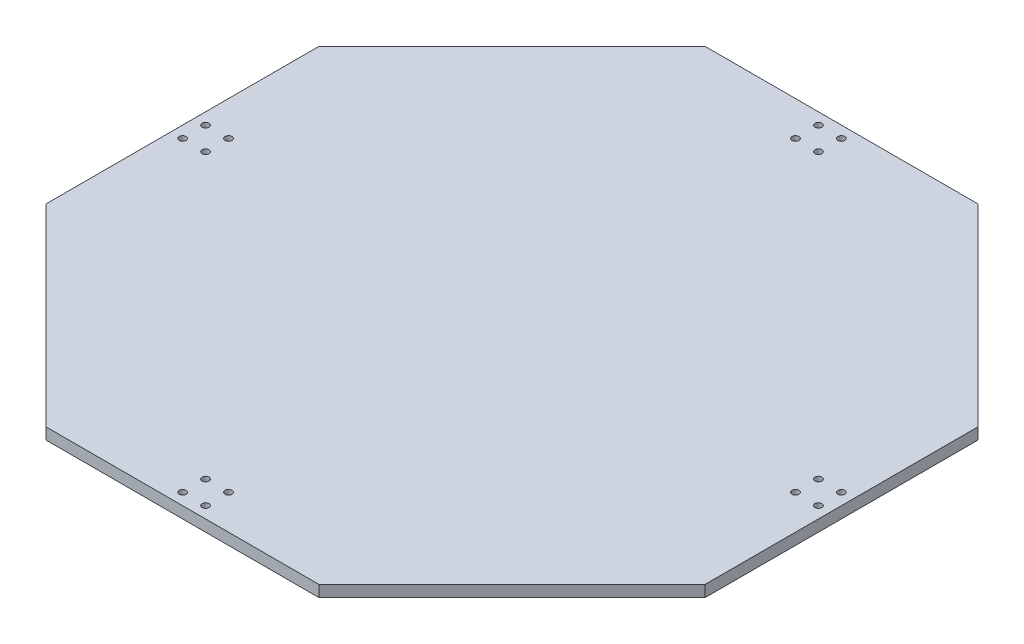
ISO-10303-21;
HEADER;
FILE_DESCRIPTION(('STEP AP214'),'2;1');
FILE_NAME('part.step','',(''),(''),'','','');
FILE_SCHEMA(('AUTOMOTIVE_DESIGN { 1 0 10303 214 1 1 1 1 }'));
ENDSEC;
DATA;
#1=APPLICATION_CONTEXT('core data for automotive mechanical design processes');
#2=APPLICATION_PROTOCOL_DEFINITION('international standard','automotive_design',2000,#1);
#3=PRODUCT_CONTEXT('',#1,'mechanical');
#4=PRODUCT('Part','Part','',(#3));
#5=PRODUCT_RELATED_PRODUCT_CATEGORY('part','',(#4));
#6=PRODUCT_DEFINITION_FORMATION('','',#4);
#7=PRODUCT_DEFINITION_CONTEXT('part definition',#1,'design');
#8=PRODUCT_DEFINITION('design','',#6,#7);
#9=PRODUCT_DEFINITION_SHAPE('','',#8);
#10=(LENGTH_UNIT() NAMED_UNIT(*) SI_UNIT(.MILLI.,.METRE.));
#11=(NAMED_UNIT(*) PLANE_ANGLE_UNIT() SI_UNIT($,.RADIAN.));
#12=(NAMED_UNIT(*) SI_UNIT($,.STERADIAN.) SOLID_ANGLE_UNIT());
#13=UNCERTAINTY_MEASURE_WITH_UNIT(LENGTH_MEASURE(1.E-05),#10,'distance_accuracy_value','');
#14=(GEOMETRIC_REPRESENTATION_CONTEXT(3) GLOBAL_UNCERTAINTY_ASSIGNED_CONTEXT((#13)) GLOBAL_UNIT_ASSIGNED_CONTEXT((#10,
#11,#12)) REPRESENTATION_CONTEXT('',''));
#15=CARTESIAN_POINT('',(0.,0.,0.));
#16=DIRECTION('',(0.,0.,1.));
#17=DIRECTION('',(1.,0.,0.));
#18=AXIS2_PLACEMENT_3D('',#15,#16,#17);
#19=CARTESIAN_POINT('',(0.,5.,0.));
#20=DIRECTION('',(0.,1.,0.));
#21=DIRECTION('',(0.,0.,1.));
#22=AXIS2_PLACEMENT_3D('',#19,#20,#21);
#23=PLANE('',#22);
#24=CARTESIAN_POINT('',(-128.539999999997,5.,-4.99999999999743));
#25=DIRECTION('',(0.,1.,0.));
#26=DIRECTION('',(0.,0.,-1.));
#27=AXIS2_PLACEMENT_3D('',#24,#25,#26);
#28=CIRCLE('',#27,1.5);
#29=CARTESIAN_POINT('',(-128.539999999997,5.,-6.49999999999743));
#30=VERTEX_POINT('',#29);
#31=EDGE_CURVE('E259',#30,#30,#28,.T.);
#32=ORIENTED_EDGE('',*,*,#31,.F.);
#33=EDGE_LOOP('',(#32));
#34=FACE_BOUND('',#33,.T.);
#35=CARTESIAN_POINT('',(-138.539999999997,5.,5.00000000000255));
#36=DIRECTION('',(0.,1.,0.));
#37=DIRECTION('',(0.,0.,1.));
#38=AXIS2_PLACEMENT_3D('',#35,#36,#37);
#39=CIRCLE('',#38,1.5);
#40=CARTESIAN_POINT('',(-138.539999999997,5.,6.50000000000255));
#41=VERTEX_POINT('',#40);
#42=EDGE_CURVE('E247',#41,#41,#39,.T.);
#43=ORIENTED_EDGE('',*,*,#42,.F.);
#44=EDGE_LOOP('',(#43));
#45=FACE_BOUND('',#44,.T.);
#46=CARTESIAN_POINT('',(-4.99999999999468,5.,128.54));
#47=DIRECTION('',(0.,1.,0.));
#48=DIRECTION('',(0.,0.,-1.));
#49=AXIS2_PLACEMENT_3D('',#46,#47,#48);
#50=CIRCLE('',#49,1.5);
#51=CARTESIAN_POINT('',(-4.99999999999468,5.,127.04));
#52=VERTEX_POINT('',#51);
#53=EDGE_CURVE('E235',#52,#52,#50,.T.);
#54=ORIENTED_EDGE('',*,*,#53,.F.);
#55=EDGE_LOOP('',(#54));
#56=FACE_BOUND('',#55,.T.);
#57=CARTESIAN_POINT('',(5.00000000000531,5.,138.54));
#58=DIRECTION('',(0.,1.,0.));
#59=DIRECTION('',(0.,0.,1.));
#60=AXIS2_PLACEMENT_3D('',#57,#58,#59);
#61=CIRCLE('',#60,1.50000000000001);
#62=CARTESIAN_POINT('',(5.00000000000531,5.,140.04));
#63=VERTEX_POINT('',#62);
#64=EDGE_CURVE('E223',#63,#63,#61,.T.);
#65=ORIENTED_EDGE('',*,*,#64,.F.);
#66=EDGE_LOOP('',(#65));
#67=FACE_BOUND('',#66,.T.);
#68=CARTESIAN_POINT('',(128.540000000003,5.,4.99999999999723));
#69=DIRECTION('',(0.,1.,0.));
#70=DIRECTION('',(0.,0.,-1.));
#71=AXIS2_PLACEMENT_3D('',#68,#69,#70);
#72=CIRCLE('',#71,1.5);
#73=CARTESIAN_POINT('',(128.540000000003,5.,3.49999999999723));
#74=VERTEX_POINT('',#73);
#75=EDGE_CURVE('E211',#74,#74,#72,.T.);
#76=ORIENTED_EDGE('',*,*,#75,.F.);
#77=EDGE_LOOP('',(#76));
#78=FACE_BOUND('',#77,.T.);
#79=CARTESIAN_POINT('',(138.540000000003,5.,-5.00000000000276));
#80=DIRECTION('',(0.,1.,0.));
#81=DIRECTION('',(0.,0.,1.));
#82=AXIS2_PLACEMENT_3D('',#79,#80,#81);
#83=CIRCLE('',#82,1.5);
#84=CARTESIAN_POINT('',(138.540000000003,5.,-3.50000000000276));
#85=VERTEX_POINT('',#84);
#86=EDGE_CURVE('E199',#85,#85,#83,.T.);
#87=ORIENTED_EDGE('',*,*,#86,.F.);
#88=EDGE_LOOP('',(#87));
#89=FACE_BOUND('',#88,.T.);
#90=CARTESIAN_POINT('',(5.,5.,-128.54));
#91=DIRECTION('',(0.,1.,0.));
#92=DIRECTION('',(0.,0.,-1.));
#93=AXIS2_PLACEMENT_3D('',#90,#91,#92);
#94=CIRCLE('',#93,1.5);
#95=CARTESIAN_POINT('',(5.,5.,-130.04));
#96=VERTEX_POINT('',#95);
#97=EDGE_CURVE('E187',#96,#96,#94,.T.);
#98=ORIENTED_EDGE('',*,*,#97,.F.);
#99=EDGE_LOOP('',(#98));
#100=FACE_BOUND('',#99,.T.);
#101=CARTESIAN_POINT('',(-4.99999999999998,5.,-138.54));
#102=DIRECTION('',(0.,1.,0.));
#103=DIRECTION('',(0.,0.,1.));
#104=AXIS2_PLACEMENT_3D('',#101,#102,#103);
#105=CIRCLE('',#104,1.5);
#106=CARTESIAN_POINT('',(-4.99999999999998,5.,-137.04));
#107=VERTEX_POINT('',#106);
#108=EDGE_CURVE('E133',#107,#107,#105,.T.);
#109=ORIENTED_EDGE('',*,*,#108,.F.);
#110=EDGE_LOOP('',(#109));
#111=FACE_BOUND('',#110,.T.);
#112=DIRECTION('',(1.,0.,0.));
#113=VECTOR('',#112,1.);
#114=CARTESIAN_POINT('',(-59.4810675567764,5.,143.6));
#115=LINE('',#114,#113);
#116=CARTESIAN_POINT('',(-59.4810675567764,5.,143.6));
#117=VERTEX_POINT('',#116);
#118=CARTESIAN_POINT('',(59.4810675567765,5.,143.6));
#119=VERTEX_POINT('',#118);
#120=EDGE_CURVE('E144',#117,#119,#115,.T.);
#121=ORIENTED_EDGE('',*,*,#120,.T.);
#122=DIRECTION('',(0.707106781186547,0.,-0.707106781186548));
#123=VECTOR('',#122,1.);
#124=CARTESIAN_POINT('',(59.4810675567765,5.,143.6));
#125=LINE('',#124,#123);
#126=CARTESIAN_POINT('',(143.6,5.,59.4810675567764));
#127=VERTEX_POINT('',#126);
#128=EDGE_CURVE('E92',#119,#127,#125,.T.);
#129=ORIENTED_EDGE('',*,*,#128,.T.);
#130=DIRECTION('',(0.,0.,-1.));
#131=VECTOR('',#130,1.);
#132=CARTESIAN_POINT('',(143.6,5.,59.4810675567764));
#133=LINE('',#132,#131);
#134=CARTESIAN_POINT('',(143.6,5.,-59.4810675567765));
#135=VERTEX_POINT('',#134);
#136=EDGE_CURVE('E159',#127,#135,#133,.T.);
#137=ORIENTED_EDGE('',*,*,#136,.T.);
#138=DIRECTION('',(-0.707106781186548,0.,-0.707106781186547));
#139=VECTOR('',#138,1.);
#140=CARTESIAN_POINT('',(143.6,5.,-59.4810675567765));
#141=LINE('',#140,#139);
#142=CARTESIAN_POINT('',(59.4810675567764,5.,-143.6));
#143=VERTEX_POINT('',#142);
#144=EDGE_CURVE('E172',#135,#143,#141,.T.);
#145=ORIENTED_EDGE('',*,*,#144,.T.);
#146=DIRECTION('',(-1.,0.,0.));
#147=VECTOR('',#146,1.);
#148=CARTESIAN_POINT('',(59.4810675567764,5.,-143.6));
#149=LINE('',#148,#147);
#150=CARTESIAN_POINT('',(-59.4810675567765,5.,-143.6));
#151=VERTEX_POINT('',#150);
#152=EDGE_CURVE('E111',#143,#151,#149,.T.);
#153=ORIENTED_EDGE('',*,*,#152,.T.);
#154=DIRECTION('',(-0.707106781186547,0.,0.707106781186548));
#155=VECTOR('',#154,1.);
#156=CARTESIAN_POINT('',(-59.4810675567765,5.,-143.6));
#157=LINE('',#156,#155);
#158=CARTESIAN_POINT('',(-143.6,5.,-59.4810675567764));
#159=VERTEX_POINT('',#158);
#160=EDGE_CURVE('E105',#151,#159,#157,.T.);
#161=ORIENTED_EDGE('',*,*,#160,.T.);
#162=DIRECTION('',(0.,0.,1.));
#163=VECTOR('',#162,1.);
#164=CARTESIAN_POINT('',(-143.6,5.,-59.4810675567764));
#165=LINE('',#164,#163);
#166=CARTESIAN_POINT('',(-143.6,5.,59.4810675567765));
#167=VERTEX_POINT('',#166);
#168=EDGE_CURVE('E109',#159,#167,#165,.T.);
#169=ORIENTED_EDGE('',*,*,#168,.T.);
#170=DIRECTION('',(0.707106781186547,0.,0.707106781186548));
#171=VECTOR('',#170,1.);
#172=CARTESIAN_POINT('',(-143.6,5.,59.4810675567765));
#173=LINE('',#172,#171);
#174=EDGE_CURVE('E49',#167,#117,#173,.T.);
#175=ORIENTED_EDGE('',*,*,#174,.T.);
#176=EDGE_LOOP('',(#121,#129,#137,#145,#153,#161,#169,#175));
#177=FACE_BOUND('',#176,.T.);
#178=CARTESIAN_POINT('',(-4.99999999999996,5.,-128.54));
#179=DIRECTION('',(0.,1.,0.));
#180=DIRECTION('',(0.,0.,1.));
#181=AXIS2_PLACEMENT_3D('',#178,#179,#180);
#182=CIRCLE('',#181,1.49999999999997);
#183=CARTESIAN_POINT('',(-4.99999999999996,5.,-127.04));
#184=VERTEX_POINT('',#183);
#185=EDGE_CURVE('E181',#184,#184,#182,.T.);
#186=ORIENTED_EDGE('',*,*,#185,.F.);
#187=EDGE_LOOP('',(#186));
#188=FACE_BOUND('',#187,.T.);
#189=CARTESIAN_POINT('',(5.00000000000002,5.,-138.54));
#190=DIRECTION('',(0.,1.,0.));
#191=DIRECTION('',(0.,0.,-1.));
#192=AXIS2_PLACEMENT_3D('',#189,#190,#191);
#193=CIRCLE('',#192,1.5);
#194=CARTESIAN_POINT('',(5.00000000000002,5.,-140.04));
#195=VERTEX_POINT('',#194);
#196=EDGE_CURVE('E193',#195,#195,#193,.T.);
#197=ORIENTED_EDGE('',*,*,#196,.F.);
#198=EDGE_LOOP('',(#197));
#199=FACE_BOUND('',#198,.T.);
#200=CARTESIAN_POINT('',(128.540000000003,5.,-5.00000000000273));
#201=DIRECTION('',(0.,1.,0.));
#202=DIRECTION('',(0.,0.,1.));
#203=AXIS2_PLACEMENT_3D('',#200,#201,#202);
#204=CIRCLE('',#203,1.5);
#205=CARTESIAN_POINT('',(128.540000000003,5.,-3.50000000000274));
#206=VERTEX_POINT('',#205);
#207=EDGE_CURVE('E205',#206,#206,#204,.T.);
#208=ORIENTED_EDGE('',*,*,#207,.F.);
#209=EDGE_LOOP('',(#208));
#210=FACE_BOUND('',#209,.T.);
#211=CARTESIAN_POINT('',(138.540000000003,5.,4.99999999999725));
#212=DIRECTION('',(0.,1.,0.));
#213=DIRECTION('',(0.,0.,-1.));
#214=AXIS2_PLACEMENT_3D('',#211,#212,#213);
#215=CIRCLE('',#214,1.5);
#216=CARTESIAN_POINT('',(138.540000000003,5.,3.49999999999725));
#217=VERTEX_POINT('',#216);
#218=EDGE_CURVE('E217',#217,#217,#215,.T.);
#219=ORIENTED_EDGE('',*,*,#218,.F.);
#220=EDGE_LOOP('',(#219));
#221=FACE_BOUND('',#220,.T.);
#222=CARTESIAN_POINT('',(5.00000000000528,5.,128.54));
#223=DIRECTION('',(0.,1.,0.));
#224=DIRECTION('',(0.,0.,1.));
#225=AXIS2_PLACEMENT_3D('',#222,#223,#224);
#226=CIRCLE('',#225,1.5);
#227=CARTESIAN_POINT('',(5.00000000000528,5.,130.04));
#228=VERTEX_POINT('',#227);
#229=EDGE_CURVE('E229',#228,#228,#226,.T.);
#230=ORIENTED_EDGE('',*,*,#229,.F.);
#231=EDGE_LOOP('',(#230));
#232=FACE_BOUND('',#231,.T.);
#233=CARTESIAN_POINT('',(-4.99999999999469,5.,138.54));
#234=DIRECTION('',(0.,1.,0.));
#235=DIRECTION('',(0.,0.,-1.));
#236=AXIS2_PLACEMENT_3D('',#233,#234,#235);
#237=CIRCLE('',#236,1.5);
#238=CARTESIAN_POINT('',(-4.99999999999469,5.,137.04));
#239=VERTEX_POINT('',#238);
#240=EDGE_CURVE('E241',#239,#239,#237,.T.);
#241=ORIENTED_EDGE('',*,*,#240,.F.);
#242=EDGE_LOOP('',(#241));
#243=FACE_BOUND('',#242,.T.);
#244=CARTESIAN_POINT('',(-128.539999999997,5.,5.00000000000253));
#245=DIRECTION('',(0.,1.,0.));
#246=DIRECTION('',(0.,0.,1.));
#247=AXIS2_PLACEMENT_3D('',#244,#245,#246);
#248=CIRCLE('',#247,1.5);
#249=CARTESIAN_POINT('',(-128.539999999997,5.,6.50000000000252));
#250=VERTEX_POINT('',#249);
#251=EDGE_CURVE('E253',#250,#250,#248,.T.);
#252=ORIENTED_EDGE('',*,*,#251,.F.);
#253=EDGE_LOOP('',(#252));
#254=FACE_BOUND('',#253,.T.);
#255=CARTESIAN_POINT('',(-138.539999999997,5.,-4.99999999999745));
#256=DIRECTION('',(0.,1.,0.));
#257=DIRECTION('',(0.,0.,-1.));
#258=AXIS2_PLACEMENT_3D('',#255,#256,#257);
#259=CIRCLE('',#258,1.5);
#260=CARTESIAN_POINT('',(-138.539999999997,5.,-6.49999999999745));
#261=VERTEX_POINT('',#260);
#262=EDGE_CURVE('E265',#261,#261,#259,.T.);
#263=ORIENTED_EDGE('',*,*,#262,.F.);
#264=EDGE_LOOP('',(#263));
#265=FACE_BOUND('',#264,.T.);
#266=ADVANCED_FACE('F32',(#34,#45,#56,#67,#78,#89,#100,#111,#177,#188,#199,#210,#221,#232,#243,
#254,#265),#23,.T.);
#267=CARTESIAN_POINT('',(0.,0.,0.));
#268=DIRECTION('',(0.,1.,0.));
#269=DIRECTION('',(0.,0.,1.));
#270=AXIS2_PLACEMENT_3D('',#267,#268,#269);
#271=PLANE('',#270);
#272=DIRECTION('',(1.,0.,0.));
#273=VECTOR('',#272,1.);
#274=CARTESIAN_POINT('',(-59.4810675567764,0.,143.6));
#275=LINE('',#274,#273);
#276=CARTESIAN_POINT('',(-59.4810675567764,0.,143.6));
#277=VERTEX_POINT('',#276);
#278=CARTESIAN_POINT('',(59.4810675567765,0.,143.6));
#279=VERTEX_POINT('',#278);
#280=EDGE_CURVE('E129',#277,#279,#275,.T.);
#281=ORIENTED_EDGE('',*,*,#280,.F.);
#282=DIRECTION('',(0.707106781186547,0.,0.707106781186548));
#283=VECTOR('',#282,1.);
#284=CARTESIAN_POINT('',(-143.6,0.,59.4810675567765));
#285=LINE('',#284,#283);
#286=CARTESIAN_POINT('',(-143.6,0.,59.4810675567765));
#287=VERTEX_POINT('',#286);
#288=EDGE_CURVE('E84',#287,#277,#285,.T.);
#289=ORIENTED_EDGE('',*,*,#288,.F.);
#290=DIRECTION('',(0.,0.,1.));
#291=VECTOR('',#290,1.);
#292=CARTESIAN_POINT('',(-143.6,0.,-59.4810675567764));
#293=LINE('',#292,#291);
#294=CARTESIAN_POINT('',(-143.6,0.,-59.4810675567764));
#295=VERTEX_POINT('',#294);
#296=EDGE_CURVE('E78',#295,#287,#293,.T.);
#297=ORIENTED_EDGE('',*,*,#296,.F.);
#298=DIRECTION('',(-0.707106781186547,0.,0.707106781186548));
#299=VECTOR('',#298,1.);
#300=CARTESIAN_POINT('',(-59.4810675567765,0.,-143.6));
#301=LINE('',#300,#299);
#302=CARTESIAN_POINT('',(-59.4810675567765,0.,-143.6));
#303=VERTEX_POINT('',#302);
#304=EDGE_CURVE('E119',#303,#295,#301,.T.);
#305=ORIENTED_EDGE('',*,*,#304,.F.);
#306=DIRECTION('',(-1.,0.,0.));
#307=VECTOR('',#306,1.);
#308=CARTESIAN_POINT('',(59.4810675567764,0.,-143.6));
#309=LINE('',#308,#307);
#310=CARTESIAN_POINT('',(59.4810675567764,0.,-143.6));
#311=VERTEX_POINT('',#310);
#312=EDGE_CURVE('E139',#311,#303,#309,.T.);
#313=ORIENTED_EDGE('',*,*,#312,.F.);
#314=DIRECTION('',(-0.707106781186548,0.,-0.707106781186547));
#315=VECTOR('',#314,1.);
#316=CARTESIAN_POINT('',(143.6,0.,-59.4810675567765));
#317=LINE('',#316,#315);
#318=CARTESIAN_POINT('',(143.6,0.,-59.4810675567765));
#319=VERTEX_POINT('',#318);
#320=EDGE_CURVE('E137',#319,#311,#317,.T.);
#321=ORIENTED_EDGE('',*,*,#320,.F.);
#322=DIRECTION('',(0.,0.,-1.));
#323=VECTOR('',#322,1.);
#324=CARTESIAN_POINT('',(143.6,0.,59.4810675567764));
#325=LINE('',#324,#323);
#326=CARTESIAN_POINT('',(143.6,0.,59.4810675567764));
#327=VERTEX_POINT('',#326);
#328=EDGE_CURVE('E135',#327,#319,#325,.T.);
#329=ORIENTED_EDGE('',*,*,#328,.F.);
#330=DIRECTION('',(0.707106781186547,0.,-0.707106781186548));
#331=VECTOR('',#330,1.);
#332=CARTESIAN_POINT('',(59.4810675567765,0.,143.6));
#333=LINE('',#332,#331);
#334=EDGE_CURVE('E132',#279,#327,#333,.T.);
#335=ORIENTED_EDGE('',*,*,#334,.F.);
#336=EDGE_LOOP('',(#281,#289,#297,#305,#313,#321,#329,#335));
#337=FACE_BOUND('',#336,.T.);
#338=CARTESIAN_POINT('',(-4.99999999999998,0.,-138.54));
#339=DIRECTION('',(0.,1.,0.));
#340=DIRECTION('',(0.,0.,1.));
#341=AXIS2_PLACEMENT_3D('',#338,#339,#340);
#342=CIRCLE('',#341,1.5);
#343=CARTESIAN_POINT('',(-4.99999999999998,0.,-137.04));
#344=VERTEX_POINT('',#343);
#345=EDGE_CURVE('E178',#344,#344,#342,.T.);
#346=ORIENTED_EDGE('',*,*,#345,.T.);
#347=EDGE_LOOP('',(#346));
#348=FACE_BOUND('',#347,.T.);
#349=CARTESIAN_POINT('',(-4.99999999999996,0.,-128.54));
#350=DIRECTION('',(0.,1.,0.));
#351=DIRECTION('',(0.,0.,1.));
#352=AXIS2_PLACEMENT_3D('',#349,#350,#351);
#353=CIRCLE('',#352,1.49999999999997);
#354=CARTESIAN_POINT('',(-4.99999999999996,0.,-127.04));
#355=VERTEX_POINT('',#354);
#356=EDGE_CURVE('E184',#355,#355,#353,.T.);
#357=ORIENTED_EDGE('',*,*,#356,.T.);
#358=EDGE_LOOP('',(#357));
#359=FACE_BOUND('',#358,.T.);
#360=CARTESIAN_POINT('',(5.,0.,-128.54));
#361=DIRECTION('',(0.,1.,0.));
#362=DIRECTION('',(0.,0.,-1.));
#363=AXIS2_PLACEMENT_3D('',#360,#361,#362);
#364=CIRCLE('',#363,1.5);
#365=CARTESIAN_POINT('',(5.,0.,-130.04));
#366=VERTEX_POINT('',#365);
#367=EDGE_CURVE('E190',#366,#366,#364,.T.);
#368=ORIENTED_EDGE('',*,*,#367,.T.);
#369=EDGE_LOOP('',(#368));
#370=FACE_BOUND('',#369,.T.);
#371=CARTESIAN_POINT('',(5.00000000000002,0.,-138.54));
#372=DIRECTION('',(0.,1.,0.));
#373=DIRECTION('',(0.,0.,-1.));
#374=AXIS2_PLACEMENT_3D('',#371,#372,#373);
#375=CIRCLE('',#374,1.5);
#376=CARTESIAN_POINT('',(5.00000000000002,0.,-140.04));
#377=VERTEX_POINT('',#376);
#378=EDGE_CURVE('E196',#377,#377,#375,.T.);
#379=ORIENTED_EDGE('',*,*,#378,.T.);
#380=EDGE_LOOP('',(#379));
#381=FACE_BOUND('',#380,.T.);
#382=CARTESIAN_POINT('',(138.540000000003,0.,-5.00000000000276));
#383=DIRECTION('',(0.,1.,0.));
#384=DIRECTION('',(0.,0.,1.));
#385=AXIS2_PLACEMENT_3D('',#382,#383,#384);
#386=CIRCLE('',#385,1.5);
#387=CARTESIAN_POINT('',(138.540000000003,0.,-3.50000000000276));
#388=VERTEX_POINT('',#387);
#389=EDGE_CURVE('E202',#388,#388,#386,.T.);
#390=ORIENTED_EDGE('',*,*,#389,.T.);
#391=EDGE_LOOP('',(#390));
#392=FACE_BOUND('',#391,.T.);
#393=CARTESIAN_POINT('',(128.540000000003,0.,-5.00000000000273));
#394=DIRECTION('',(0.,1.,0.));
#395=DIRECTION('',(0.,0.,1.));
#396=AXIS2_PLACEMENT_3D('',#393,#394,#395);
#397=CIRCLE('',#396,1.5);
#398=CARTESIAN_POINT('',(128.540000000003,0.,-3.50000000000274));
#399=VERTEX_POINT('',#398);
#400=EDGE_CURVE('E208',#399,#399,#397,.T.);
#401=ORIENTED_EDGE('',*,*,#400,.T.);
#402=EDGE_LOOP('',(#401));
#403=FACE_BOUND('',#402,.T.);
#404=CARTESIAN_POINT('',(128.540000000003,0.,4.99999999999723));
#405=DIRECTION('',(0.,1.,0.));
#406=DIRECTION('',(0.,0.,-1.));
#407=AXIS2_PLACEMENT_3D('',#404,#405,#406);
#408=CIRCLE('',#407,1.5);
#409=CARTESIAN_POINT('',(128.540000000003,0.,3.49999999999723));
#410=VERTEX_POINT('',#409);
#411=EDGE_CURVE('E214',#410,#410,#408,.T.);
#412=ORIENTED_EDGE('',*,*,#411,.T.);
#413=EDGE_LOOP('',(#412));
#414=FACE_BOUND('',#413,.T.);
#415=CARTESIAN_POINT('',(138.540000000003,0.,4.99999999999725));
#416=DIRECTION('',(0.,1.,0.));
#417=DIRECTION('',(0.,0.,-1.));
#418=AXIS2_PLACEMENT_3D('',#415,#416,#417);
#419=CIRCLE('',#418,1.5);
#420=CARTESIAN_POINT('',(138.540000000003,0.,3.49999999999725));
#421=VERTEX_POINT('',#420);
#422=EDGE_CURVE('E220',#421,#421,#419,.T.);
#423=ORIENTED_EDGE('',*,*,#422,.T.);
#424=EDGE_LOOP('',(#423));
#425=FACE_BOUND('',#424,.T.);
#426=CARTESIAN_POINT('',(5.00000000000531,0.,138.54));
#427=DIRECTION('',(0.,1.,0.));
#428=DIRECTION('',(0.,0.,1.));
#429=AXIS2_PLACEMENT_3D('',#426,#427,#428);
#430=CIRCLE('',#429,1.50000000000001);
#431=CARTESIAN_POINT('',(5.00000000000531,0.,140.04));
#432=VERTEX_POINT('',#431);
#433=EDGE_CURVE('E226',#432,#432,#430,.T.);
#434=ORIENTED_EDGE('',*,*,#433,.T.);
#435=EDGE_LOOP('',(#434));
#436=FACE_BOUND('',#435,.T.);
#437=CARTESIAN_POINT('',(5.00000000000528,0.,128.54));
#438=DIRECTION('',(0.,1.,0.));
#439=DIRECTION('',(0.,0.,1.));
#440=AXIS2_PLACEMENT_3D('',#437,#438,#439);
#441=CIRCLE('',#440,1.5);
#442=CARTESIAN_POINT('',(5.00000000000528,0.,130.04));
#443=VERTEX_POINT('',#442);
#444=EDGE_CURVE('E232',#443,#443,#441,.T.);
#445=ORIENTED_EDGE('',*,*,#444,.T.);
#446=EDGE_LOOP('',(#445));
#447=FACE_BOUND('',#446,.T.);
#448=CARTESIAN_POINT('',(-4.99999999999468,0.,128.54));
#449=DIRECTION('',(0.,1.,0.));
#450=DIRECTION('',(0.,0.,-1.));
#451=AXIS2_PLACEMENT_3D('',#448,#449,#450);
#452=CIRCLE('',#451,1.5);
#453=CARTESIAN_POINT('',(-4.99999999999468,0.,127.04));
#454=VERTEX_POINT('',#453);
#455=EDGE_CURVE('E238',#454,#454,#452,.T.);
#456=ORIENTED_EDGE('',*,*,#455,.T.);
#457=EDGE_LOOP('',(#456));
#458=FACE_BOUND('',#457,.T.);
#459=CARTESIAN_POINT('',(-4.99999999999469,0.,138.54));
#460=DIRECTION('',(0.,1.,0.));
#461=DIRECTION('',(0.,0.,-1.));
#462=AXIS2_PLACEMENT_3D('',#459,#460,#461);
#463=CIRCLE('',#462,1.5);
#464=CARTESIAN_POINT('',(-4.99999999999469,0.,137.04));
#465=VERTEX_POINT('',#464);
#466=EDGE_CURVE('E244',#465,#465,#463,.T.);
#467=ORIENTED_EDGE('',*,*,#466,.T.);
#468=EDGE_LOOP('',(#467));
#469=FACE_BOUND('',#468,.T.);
#470=CARTESIAN_POINT('',(-138.539999999997,0.,5.00000000000255));
#471=DIRECTION('',(0.,1.,0.));
#472=DIRECTION('',(0.,0.,1.));
#473=AXIS2_PLACEMENT_3D('',#470,#471,#472);
#474=CIRCLE('',#473,1.5);
#475=CARTESIAN_POINT('',(-138.539999999997,0.,6.50000000000255));
#476=VERTEX_POINT('',#475);
#477=EDGE_CURVE('E250',#476,#476,#474,.T.);
#478=ORIENTED_EDGE('',*,*,#477,.T.);
#479=EDGE_LOOP('',(#478));
#480=FACE_BOUND('',#479,.T.);
#481=CARTESIAN_POINT('',(-128.539999999997,0.,5.00000000000253));
#482=DIRECTION('',(0.,1.,0.));
#483=DIRECTION('',(0.,0.,1.));
#484=AXIS2_PLACEMENT_3D('',#481,#482,#483);
#485=CIRCLE('',#484,1.5);
#486=CARTESIAN_POINT('',(-128.539999999997,0.,6.50000000000252));
#487=VERTEX_POINT('',#486);
#488=EDGE_CURVE('E256',#487,#487,#485,.T.);
#489=ORIENTED_EDGE('',*,*,#488,.T.);
#490=EDGE_LOOP('',(#489));
#491=FACE_BOUND('',#490,.T.);
#492=CARTESIAN_POINT('',(-128.539999999997,0.,-4.99999999999743));
#493=DIRECTION('',(0.,1.,0.));
#494=DIRECTION('',(0.,0.,-1.));
#495=AXIS2_PLACEMENT_3D('',#492,#493,#494);
#496=CIRCLE('',#495,1.5);
#497=CARTESIAN_POINT('',(-128.539999999997,0.,-6.49999999999743));
#498=VERTEX_POINT('',#497);
#499=EDGE_CURVE('E262',#498,#498,#496,.T.);
#500=ORIENTED_EDGE('',*,*,#499,.T.);
#501=EDGE_LOOP('',(#500));
#502=FACE_BOUND('',#501,.T.);
#503=CARTESIAN_POINT('',(-138.539999999997,0.,-4.99999999999745));
#504=DIRECTION('',(0.,1.,0.));
#505=DIRECTION('',(0.,0.,-1.));
#506=AXIS2_PLACEMENT_3D('',#503,#504,#505);
#507=CIRCLE('',#506,1.5);
#508=CARTESIAN_POINT('',(-138.539999999997,0.,-6.49999999999745));
#509=VERTEX_POINT('',#508);
#510=EDGE_CURVE('E268',#509,#509,#507,.T.);
#511=ORIENTED_EDGE('',*,*,#510,.T.);
#512=EDGE_LOOP('',(#511));
#513=FACE_BOUND('',#512,.T.);
#514=ADVANCED_FACE('F163',(#337,#348,#359,#370,#381,#392,#403,#414,#425,#436,#447,#458,#469,
#480,#491,#502,#513),#271,.F.);
#515=CARTESIAN_POINT('',(-59.4810675567764,5.,143.6));
#516=DIRECTION('',(0.,0.,-1.));
#517=DIRECTION('',(-1.,0.,0.));
#518=AXIS2_PLACEMENT_3D('',#515,#516,#517);
#519=PLANE('',#518);
#520=ORIENTED_EDGE('',*,*,#280,.T.);
#521=DIRECTION('',(0.,-1.,0.));
#522=VECTOR('',#521,1.);
#523=CARTESIAN_POINT('',(59.4810675567765,5.,143.6));
#524=LINE('',#523,#522);
#525=EDGE_CURVE('E11',#119,#279,#524,.T.);
#526=ORIENTED_EDGE('',*,*,#525,.F.);
#527=ORIENTED_EDGE('',*,*,#120,.F.);
#528=DIRECTION('',(0.,-1.,0.));
#529=VECTOR('',#528,1.);
#530=CARTESIAN_POINT('',(-59.4810675567764,5.,143.6));
#531=LINE('',#530,#529);
#532=EDGE_CURVE('E125',#117,#277,#531,.T.);
#533=ORIENTED_EDGE('',*,*,#532,.T.);
#534=EDGE_LOOP('',(#520,#526,#527,#533));
#535=FACE_BOUND('',#534,.T.);
#536=ADVANCED_FACE('F34',(#535),#519,.F.);
#537=CARTESIAN_POINT('',(59.4810675567765,5.,143.6));
#538=DIRECTION('',(-0.707106781186548,0.,-0.707106781186547));
#539=DIRECTION('',(-0.707106781186547,0.,0.707106781186548));
#540=AXIS2_PLACEMENT_3D('',#537,#538,#539);
#541=PLANE('',#540);
#542=ORIENTED_EDGE('',*,*,#334,.T.);
#543=DIRECTION('',(0.,-1.,0.));
#544=VECTOR('',#543,1.);
#545=CARTESIAN_POINT('',(143.6,5.,59.4810675567764));
#546=LINE('',#545,#544);
#547=EDGE_CURVE('E41',#127,#327,#546,.T.);
#548=ORIENTED_EDGE('',*,*,#547,.F.);
#549=ORIENTED_EDGE('',*,*,#128,.F.);
#550=ORIENTED_EDGE('',*,*,#525,.T.);
#551=EDGE_LOOP('',(#542,#548,#549,#550));
#552=FACE_BOUND('',#551,.T.);
#553=ADVANCED_FACE('F302',(#552),#541,.F.);
#554=CARTESIAN_POINT('',(143.6,5.,59.4810675567764));
#555=DIRECTION('',(-1.,0.,0.));
#556=DIRECTION('',(0.,0.,1.));
#557=AXIS2_PLACEMENT_3D('',#554,#555,#556);
#558=PLANE('',#557);
#559=ORIENTED_EDGE('',*,*,#328,.T.);
#560=DIRECTION('',(0.,-1.,0.));
#561=VECTOR('',#560,1.);
#562=CARTESIAN_POINT('',(143.6,5.,-59.4810675567765));
#563=LINE('',#562,#561);
#564=EDGE_CURVE('E151',#135,#319,#563,.T.);
#565=ORIENTED_EDGE('',*,*,#564,.F.);
#566=ORIENTED_EDGE('',*,*,#136,.F.);
#567=ORIENTED_EDGE('',*,*,#547,.T.);
#568=EDGE_LOOP('',(#559,#565,#566,#567));
#569=FACE_BOUND('',#568,.T.);
#570=ADVANCED_FACE('F157',(#569),#558,.F.);
#571=CARTESIAN_POINT('',(143.6,5.,-59.4810675567765));
#572=DIRECTION('',(-0.707106781186547,0.,0.707106781186548));
#573=DIRECTION('',(0.707106781186548,0.,0.707106781186547));
#574=AXIS2_PLACEMENT_3D('',#571,#572,#573);
#575=PLANE('',#574);
#576=ORIENTED_EDGE('',*,*,#320,.T.);
#577=DIRECTION('',(0.,-1.,0.));
#578=VECTOR('',#577,1.);
#579=CARTESIAN_POINT('',(59.4810675567764,5.,-143.6));
#580=LINE('',#579,#578);
#581=EDGE_CURVE('E148',#143,#311,#580,.T.);
#582=ORIENTED_EDGE('',*,*,#581,.F.);
#583=ORIENTED_EDGE('',*,*,#144,.F.);
#584=ORIENTED_EDGE('',*,*,#564,.T.);
#585=EDGE_LOOP('',(#576,#582,#583,#584));
#586=FACE_BOUND('',#585,.T.);
#587=ADVANCED_FACE('F168',(#586),#575,.F.);
#588=CARTESIAN_POINT('',(59.4810675567764,5.,-143.6));
#589=DIRECTION('',(0.,0.,1.));
#590=DIRECTION('',(1.,0.,0.));
#591=AXIS2_PLACEMENT_3D('',#588,#589,#590);
#592=PLANE('',#591);
#593=ORIENTED_EDGE('',*,*,#312,.T.);
#594=DIRECTION('',(0.,-1.,0.));
#595=VECTOR('',#594,1.);
#596=CARTESIAN_POINT('',(-59.4810675567765,5.,-143.6));
#597=LINE('',#596,#595);
#598=EDGE_CURVE('E120',#151,#303,#597,.T.);
#599=ORIENTED_EDGE('',*,*,#598,.F.);
#600=ORIENTED_EDGE('',*,*,#152,.F.);
#601=ORIENTED_EDGE('',*,*,#581,.T.);
#602=EDGE_LOOP('',(#593,#599,#600,#601));
#603=FACE_BOUND('',#602,.T.);
#604=ADVANCED_FACE('F171',(#603),#592,.F.);
#605=CARTESIAN_POINT('',(-59.4810675567765,5.,-143.6));
#606=DIRECTION('',(0.707106781186548,0.,0.707106781186547));
#607=DIRECTION('',(0.707106781186547,0.,-0.707106781186548));
#608=AXIS2_PLACEMENT_3D('',#605,#606,#607);
#609=PLANE('',#608);
#610=ORIENTED_EDGE('',*,*,#304,.T.);
#611=DIRECTION('',(0.,-1.,0.));
#612=VECTOR('',#611,1.);
#613=CARTESIAN_POINT('',(-143.6,5.,-59.4810675567764));
#614=LINE('',#613,#612);
#615=EDGE_CURVE('E116',#159,#295,#614,.T.);
#616=ORIENTED_EDGE('',*,*,#615,.F.);
#617=ORIENTED_EDGE('',*,*,#160,.F.);
#618=ORIENTED_EDGE('',*,*,#598,.T.);
#619=EDGE_LOOP('',(#610,#616,#617,#618));
#620=FACE_BOUND('',#619,.T.);
#621=ADVANCED_FACE('F117',(#620),#609,.F.);
#622=CARTESIAN_POINT('',(-143.6,5.,-59.4810675567764));
#623=DIRECTION('',(1.,0.,0.));
#624=DIRECTION('',(0.,0.,-1.));
#625=AXIS2_PLACEMENT_3D('',#622,#623,#624);
#626=PLANE('',#625);
#627=ORIENTED_EDGE('',*,*,#296,.T.);
#628=DIRECTION('',(0.,-1.,0.));
#629=VECTOR('',#628,1.);
#630=CARTESIAN_POINT('',(-143.6,5.,59.4810675567765));
#631=LINE('',#630,#629);
#632=EDGE_CURVE('E121',#167,#287,#631,.T.);
#633=ORIENTED_EDGE('',*,*,#632,.F.);
#634=ORIENTED_EDGE('',*,*,#168,.F.);
#635=ORIENTED_EDGE('',*,*,#615,.T.);
#636=EDGE_LOOP('',(#627,#633,#634,#635));
#637=FACE_BOUND('',#636,.T.);
#638=ADVANCED_FACE('F123',(#637),#626,.F.);
#639=CARTESIAN_POINT('',(-143.6,5.,59.4810675567765));
#640=DIRECTION('',(0.707106781186548,0.,-0.707106781186547));
#641=DIRECTION('',(-0.707106781186547,0.,-0.707106781186548));
#642=AXIS2_PLACEMENT_3D('',#639,#640,#641);
#643=PLANE('',#642);
#644=ORIENTED_EDGE('',*,*,#288,.T.);
#645=ORIENTED_EDGE('',*,*,#532,.F.);
#646=ORIENTED_EDGE('',*,*,#174,.F.);
#647=ORIENTED_EDGE('',*,*,#632,.T.);
#648=EDGE_LOOP('',(#644,#645,#646,#647));
#649=FACE_BOUND('',#648,.T.);
#650=ADVANCED_FACE('F290',(#649),#643,.F.);
#651=CARTESIAN_POINT('',(-4.99999999999998,5.,-138.54));
#652=DIRECTION('',(0.,-1.,0.));
#653=DIRECTION('',(0.,0.,-1.));
#654=AXIS2_PLACEMENT_3D('',#651,#652,#653);
#655=CYLINDRICAL_SURFACE('',#654,1.5);
#656=ORIENTED_EDGE('',*,*,#108,.T.);
#657=EDGE_LOOP('',(#656));
#658=FACE_BOUND('',#657,.T.);
#659=ORIENTED_EDGE('',*,*,#345,.F.);
#660=EDGE_LOOP('',(#659));
#661=FACE_BOUND('',#660,.T.);
#662=ADVANCED_FACE('F287',(#658,#661),#655,.F.);
#663=CARTESIAN_POINT('',(-4.99999999999996,5.,-128.54));
#664=DIRECTION('',(0.,-1.,0.));
#665=DIRECTION('',(0.,0.,-1.));
#666=AXIS2_PLACEMENT_3D('',#663,#664,#665);
#667=CYLINDRICAL_SURFACE('',#666,1.49999999999997);
#668=ORIENTED_EDGE('',*,*,#185,.T.);
#669=EDGE_LOOP('',(#668));
#670=FACE_BOUND('',#669,.T.);
#671=ORIENTED_EDGE('',*,*,#356,.F.);
#672=EDGE_LOOP('',(#671));
#673=FACE_BOUND('',#672,.T.);
#674=ADVANCED_FACE('F366',(#670,#673),#667,.F.);
#675=CARTESIAN_POINT('',(5.,5.,-128.54));
#676=DIRECTION('',(0.,-1.,0.));
#677=DIRECTION('',(0.,0.,-1.));
#678=AXIS2_PLACEMENT_3D('',#675,#676,#677);
#679=CYLINDRICAL_SURFACE('',#678,1.5);
#680=ORIENTED_EDGE('',*,*,#97,.T.);
#681=EDGE_LOOP('',(#680));
#682=FACE_BOUND('',#681,.T.);
#683=ORIENTED_EDGE('',*,*,#367,.F.);
#684=EDGE_LOOP('',(#683));
#685=FACE_BOUND('',#684,.T.);
#686=ADVANCED_FACE('F374',(#682,#685),#679,.F.);
#687=CARTESIAN_POINT('',(5.00000000000002,5.,-138.54));
#688=DIRECTION('',(0.,-1.,0.));
#689=DIRECTION('',(0.,0.,-1.));
#690=AXIS2_PLACEMENT_3D('',#687,#688,#689);
#691=CYLINDRICAL_SURFACE('',#690,1.5);
#692=ORIENTED_EDGE('',*,*,#196,.T.);
#693=EDGE_LOOP('',(#692));
#694=FACE_BOUND('',#693,.T.);
#695=ORIENTED_EDGE('',*,*,#378,.F.);
#696=EDGE_LOOP('',(#695));
#697=FACE_BOUND('',#696,.T.);
#698=ADVANCED_FACE('F382',(#694,#697),#691,.F.);
#699=CARTESIAN_POINT('',(138.540000000003,5.,-5.00000000000276));
#700=DIRECTION('',(0.,-1.,0.));
#701=DIRECTION('',(0.,0.,-1.));
#702=AXIS2_PLACEMENT_3D('',#699,#700,#701);
#703=CYLINDRICAL_SURFACE('',#702,1.5);
#704=ORIENTED_EDGE('',*,*,#86,.T.);
#705=EDGE_LOOP('',(#704));
#706=FACE_BOUND('',#705,.T.);
#707=ORIENTED_EDGE('',*,*,#389,.F.);
#708=EDGE_LOOP('',(#707));
#709=FACE_BOUND('',#708,.T.);
#710=ADVANCED_FACE('F391',(#706,#709),#703,.F.);
#711=CARTESIAN_POINT('',(128.540000000003,5.,-5.00000000000273));
#712=DIRECTION('',(0.,-1.,0.));
#713=DIRECTION('',(0.,0.,-1.));
#714=AXIS2_PLACEMENT_3D('',#711,#712,#713);
#715=CYLINDRICAL_SURFACE('',#714,1.5);
#716=ORIENTED_EDGE('',*,*,#207,.T.);
#717=EDGE_LOOP('',(#716));
#718=FACE_BOUND('',#717,.T.);
#719=ORIENTED_EDGE('',*,*,#400,.F.);
#720=EDGE_LOOP('',(#719));
#721=FACE_BOUND('',#720,.T.);
#722=ADVANCED_FACE('F400',(#718,#721),#715,.F.);
#723=CARTESIAN_POINT('',(128.540000000003,5.,4.99999999999723));
#724=DIRECTION('',(0.,-1.,0.));
#725=DIRECTION('',(0.,0.,-1.));
#726=AXIS2_PLACEMENT_3D('',#723,#724,#725);
#727=CYLINDRICAL_SURFACE('',#726,1.5);
#728=ORIENTED_EDGE('',*,*,#75,.T.);
#729=EDGE_LOOP('',(#728));
#730=FACE_BOUND('',#729,.T.);
#731=ORIENTED_EDGE('',*,*,#411,.F.);
#732=EDGE_LOOP('',(#731));
#733=FACE_BOUND('',#732,.T.);
#734=ADVANCED_FACE('F409',(#730,#733),#727,.F.);
#735=CARTESIAN_POINT('',(138.540000000003,5.,4.99999999999725));
#736=DIRECTION('',(0.,-1.,0.));
#737=DIRECTION('',(0.,0.,-1.));
#738=AXIS2_PLACEMENT_3D('',#735,#736,#737);
#739=CYLINDRICAL_SURFACE('',#738,1.5);
#740=ORIENTED_EDGE('',*,*,#218,.T.);
#741=EDGE_LOOP('',(#740));
#742=FACE_BOUND('',#741,.T.);
#743=ORIENTED_EDGE('',*,*,#422,.F.);
#744=EDGE_LOOP('',(#743));
#745=FACE_BOUND('',#744,.T.);
#746=ADVANCED_FACE('F418',(#742,#745),#739,.F.);
#747=CARTESIAN_POINT('',(5.00000000000531,5.,138.54));
#748=DIRECTION('',(0.,-1.,0.));
#749=DIRECTION('',(0.,0.,-1.));
#750=AXIS2_PLACEMENT_3D('',#747,#748,#749);
#751=CYLINDRICAL_SURFACE('',#750,1.50000000000001);
#752=ORIENTED_EDGE('',*,*,#64,.T.);
#753=EDGE_LOOP('',(#752));
#754=FACE_BOUND('',#753,.T.);
#755=ORIENTED_EDGE('',*,*,#433,.F.);
#756=EDGE_LOOP('',(#755));
#757=FACE_BOUND('',#756,.T.);
#758=ADVANCED_FACE('F427',(#754,#757),#751,.F.);
#759=CARTESIAN_POINT('',(5.00000000000528,5.,128.54));
#760=DIRECTION('',(0.,-1.,0.));
#761=DIRECTION('',(0.,0.,-1.));
#762=AXIS2_PLACEMENT_3D('',#759,#760,#761);
#763=CYLINDRICAL_SURFACE('',#762,1.5);
#764=ORIENTED_EDGE('',*,*,#229,.T.);
#765=EDGE_LOOP('',(#764));
#766=FACE_BOUND('',#765,.T.);
#767=ORIENTED_EDGE('',*,*,#444,.F.);
#768=EDGE_LOOP('',(#767));
#769=FACE_BOUND('',#768,.T.);
#770=ADVANCED_FACE('F436',(#766,#769),#763,.F.);
#771=CARTESIAN_POINT('',(-4.99999999999468,5.,128.54));
#772=DIRECTION('',(0.,-1.,0.));
#773=DIRECTION('',(0.,0.,-1.));
#774=AXIS2_PLACEMENT_3D('',#771,#772,#773);
#775=CYLINDRICAL_SURFACE('',#774,1.5);
#776=ORIENTED_EDGE('',*,*,#53,.T.);
#777=EDGE_LOOP('',(#776));
#778=FACE_BOUND('',#777,.T.);
#779=ORIENTED_EDGE('',*,*,#455,.F.);
#780=EDGE_LOOP('',(#779));
#781=FACE_BOUND('',#780,.T.);
#782=ADVANCED_FACE('F445',(#778,#781),#775,.F.);
#783=CARTESIAN_POINT('',(-4.99999999999469,5.,138.54));
#784=DIRECTION('',(0.,-1.,0.));
#785=DIRECTION('',(0.,0.,-1.));
#786=AXIS2_PLACEMENT_3D('',#783,#784,#785);
#787=CYLINDRICAL_SURFACE('',#786,1.5);
#788=ORIENTED_EDGE('',*,*,#240,.T.);
#789=EDGE_LOOP('',(#788));
#790=FACE_BOUND('',#789,.T.);
#791=ORIENTED_EDGE('',*,*,#466,.F.);
#792=EDGE_LOOP('',(#791));
#793=FACE_BOUND('',#792,.T.);
#794=ADVANCED_FACE('F454',(#790,#793),#787,.F.);
#795=CARTESIAN_POINT('',(-138.539999999997,5.,5.00000000000255));
#796=DIRECTION('',(0.,-1.,0.));
#797=DIRECTION('',(0.,0.,-1.));
#798=AXIS2_PLACEMENT_3D('',#795,#796,#797);
#799=CYLINDRICAL_SURFACE('',#798,1.5);
#800=ORIENTED_EDGE('',*,*,#42,.T.);
#801=EDGE_LOOP('',(#800));
#802=FACE_BOUND('',#801,.T.);
#803=ORIENTED_EDGE('',*,*,#477,.F.);
#804=EDGE_LOOP('',(#803));
#805=FACE_BOUND('',#804,.T.);
#806=ADVANCED_FACE('F463',(#802,#805),#799,.F.);
#807=CARTESIAN_POINT('',(-128.539999999997,5.,5.00000000000253));
#808=DIRECTION('',(0.,-1.,0.));
#809=DIRECTION('',(0.,0.,-1.));
#810=AXIS2_PLACEMENT_3D('',#807,#808,#809);
#811=CYLINDRICAL_SURFACE('',#810,1.5);
#812=ORIENTED_EDGE('',*,*,#251,.T.);
#813=EDGE_LOOP('',(#812));
#814=FACE_BOUND('',#813,.T.);
#815=ORIENTED_EDGE('',*,*,#488,.F.);
#816=EDGE_LOOP('',(#815));
#817=FACE_BOUND('',#816,.T.);
#818=ADVANCED_FACE('F472',(#814,#817),#811,.F.);
#819=CARTESIAN_POINT('',(-128.539999999997,5.,-4.99999999999743));
#820=DIRECTION('',(0.,-1.,0.));
#821=DIRECTION('',(0.,0.,-1.));
#822=AXIS2_PLACEMENT_3D('',#819,#820,#821);
#823=CYLINDRICAL_SURFACE('',#822,1.5);
#824=ORIENTED_EDGE('',*,*,#31,.T.);
#825=EDGE_LOOP('',(#824));
#826=FACE_BOUND('',#825,.T.);
#827=ORIENTED_EDGE('',*,*,#499,.F.);
#828=EDGE_LOOP('',(#827));
#829=FACE_BOUND('',#828,.T.);
#830=ADVANCED_FACE('F481',(#826,#829),#823,.F.);
#831=CARTESIAN_POINT('',(-138.539999999997,5.,-4.99999999999745));
#832=DIRECTION('',(0.,-1.,0.));
#833=DIRECTION('',(0.,0.,-1.));
#834=AXIS2_PLACEMENT_3D('',#831,#832,#833);
#835=CYLINDRICAL_SURFACE('',#834,1.5);
#836=ORIENTED_EDGE('',*,*,#262,.T.);
#837=EDGE_LOOP('',(#836));
#838=FACE_BOUND('',#837,.T.);
#839=ORIENTED_EDGE('',*,*,#510,.F.);
#840=EDGE_LOOP('',(#839));
#841=FACE_BOUND('',#840,.T.);
#842=ADVANCED_FACE('F274',(#838,#841),#835,.F.);
#843=CLOSED_SHELL('',(#266,#514,#536,#553,#570,#587,#604,#621,#638,#650,#662,#674,#686,#698,
#710,#722,#734,#746,#758,#770,#782,#794,#806,#818,#830,#842));
#844=MANIFOLD_SOLID_BREP('B2',#843);
#845=ADVANCED_BREP_SHAPE_REPRESENTATION('',(#18,#844),#14);
#846=SHAPE_DEFINITION_REPRESENTATION(#9,#845);
ENDSEC;
END-ISO-10303-21;
